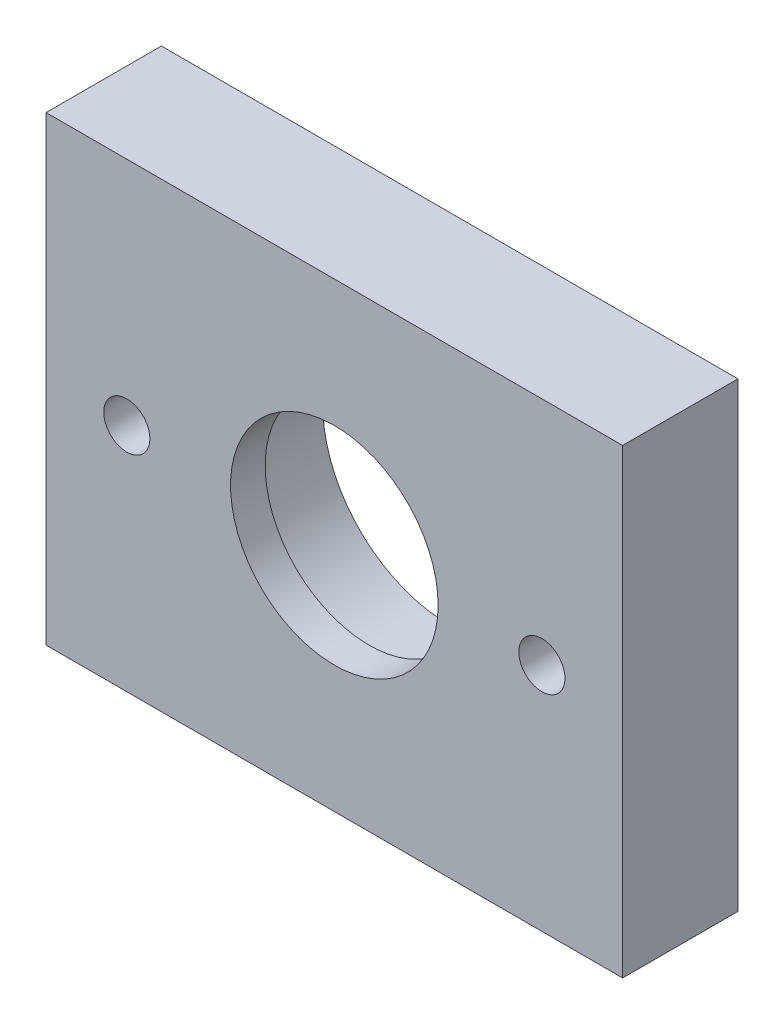
ISO-10303-21;
HEADER;
FILE_DESCRIPTION(('STEP AP214'),'2;1');
FILE_NAME('part.step','',(''),(''),'','','');
FILE_SCHEMA(('AUTOMOTIVE_DESIGN { 1 0 10303 214 1 1 1 1 }'));
ENDSEC;
DATA;
#1=APPLICATION_CONTEXT('core data for automotive mechanical design processes');
#2=APPLICATION_PROTOCOL_DEFINITION('international standard','automotive_design',2000,#1);
#3=PRODUCT_CONTEXT('',#1,'mechanical');
#4=PRODUCT('Part','Part','',(#3));
#5=PRODUCT_RELATED_PRODUCT_CATEGORY('part','',(#4));
#6=PRODUCT_DEFINITION_FORMATION('','',#4);
#7=PRODUCT_DEFINITION_CONTEXT('part definition',#1,'design');
#8=PRODUCT_DEFINITION('design','',#6,#7);
#9=PRODUCT_DEFINITION_SHAPE('','',#8);
#10=(LENGTH_UNIT() NAMED_UNIT(*) SI_UNIT(.MILLI.,.METRE.));
#11=(NAMED_UNIT(*) PLANE_ANGLE_UNIT() SI_UNIT($,.RADIAN.));
#12=(NAMED_UNIT(*) SI_UNIT($,.STERADIAN.) SOLID_ANGLE_UNIT());
#13=UNCERTAINTY_MEASURE_WITH_UNIT(LENGTH_MEASURE(1.E-05),#10,'distance_accuracy_value','');
#14=(GEOMETRIC_REPRESENTATION_CONTEXT(3) GLOBAL_UNCERTAINTY_ASSIGNED_CONTEXT((#13)) GLOBAL_UNIT_ASSIGNED_CONTEXT((#10,
#11,#12)) REPRESENTATION_CONTEXT('',''));
#15=CARTESIAN_POINT('',(0.,0.,0.));
#16=DIRECTION('',(0.,0.,1.));
#17=DIRECTION('',(1.,0.,0.));
#18=AXIS2_PLACEMENT_3D('',#15,#16,#17);
#19=CARTESIAN_POINT('',(0.,0.,10.));
#20=DIRECTION('',(0.,0.,-1.));
#21=DIRECTION('',(-1.,0.,0.));
#22=AXIS2_PLACEMENT_3D('',#19,#20,#21);
#23=CYLINDRICAL_SURFACE('',#22,11.);
#24=CARTESIAN_POINT('',(0.,0.,0.));
#25=DIRECTION('',(0.,0.,1.));
#26=DIRECTION('',(1.,0.,0.));
#27=AXIS2_PLACEMENT_3D('',#24,#25,#26);
#28=CIRCLE('',#27,11.);
#29=CARTESIAN_POINT('',(11.,0.,0.));
#30=VERTEX_POINT('',#29);
#31=EDGE_CURVE('E113',#30,#30,#28,.T.);
#32=ORIENTED_EDGE('',*,*,#31,.F.);
#33=EDGE_LOOP('',(#32));
#34=FACE_BOUND('',#33,.T.);
#35=CARTESIAN_POINT('',(0.,0.,7.));
#36=DIRECTION('',(0.,0.,1.));
#37=DIRECTION('',(1.,0.,0.));
#38=AXIS2_PLACEMENT_3D('',#35,#36,#37);
#39=CIRCLE('',#38,11.);
#40=CARTESIAN_POINT('',(11.,0.,7.));
#41=VERTEX_POINT('',#40);
#42=EDGE_CURVE('E147',#41,#41,#39,.T.);
#43=ORIENTED_EDGE('',*,*,#42,.T.);
#44=EDGE_LOOP('',(#43));
#45=FACE_BOUND('',#44,.T.);
#46=ADVANCED_FACE('F39',(#34,#45),#23,.F.);
#47=CARTESIAN_POINT('',(0.,0.,10.));
#48=DIRECTION('',(0.,0.,-1.));
#49=DIRECTION('',(-1.,0.,0.));
#50=AXIS2_PLACEMENT_3D('',#47,#48,#49);
#51=PLANE('',#50);
#52=DIRECTION('',(0.,1.,0.));
#53=VECTOR('',#52,1.);
#54=CARTESIAN_POINT('',(25.,-20.,10.));
#55=LINE('',#54,#53);
#56=CARTESIAN_POINT('',(25.,-20.,10.));
#57=VERTEX_POINT('',#56);
#58=CARTESIAN_POINT('',(25.,20.,10.));
#59=VERTEX_POINT('',#58);
#60=EDGE_CURVE('E93',#57,#59,#55,.T.);
#61=ORIENTED_EDGE('',*,*,#60,.T.);
#62=DIRECTION('',(-1.,0.,0.));
#63=VECTOR('',#62,1.);
#64=CARTESIAN_POINT('',(-25.,20.,10.));
#65=LINE('',#64,#63);
#66=CARTESIAN_POINT('',(-25.,20.,10.));
#67=VERTEX_POINT('',#66);
#68=EDGE_CURVE('E87',#59,#67,#65,.T.);
#69=ORIENTED_EDGE('',*,*,#68,.T.);
#70=DIRECTION('',(0.,-1.,0.));
#71=VECTOR('',#70,1.);
#72=CARTESIAN_POINT('',(-25.,-20.,10.));
#73=LINE('',#72,#71);
#74=CARTESIAN_POINT('',(-25.,-20.,10.));
#75=VERTEX_POINT('',#74);
#76=EDGE_CURVE('E91',#67,#75,#73,.T.);
#77=ORIENTED_EDGE('',*,*,#76,.T.);
#78=DIRECTION('',(1.,0.,0.));
#79=VECTOR('',#78,1.);
#80=CARTESIAN_POINT('',(-25.,-20.,10.));
#81=LINE('',#80,#79);
#82=EDGE_CURVE('E57',#75,#57,#81,.T.);
#83=ORIENTED_EDGE('',*,*,#82,.T.);
#84=EDGE_LOOP('',(#61,#69,#77,#83));
#85=FACE_BOUND('',#84,.T.);
#86=CARTESIAN_POINT('',(-18.,0.,10.));
#87=DIRECTION('',(0.,0.,1.));
#88=DIRECTION('',(1.,0.,0.));
#89=AXIS2_PLACEMENT_3D('',#86,#87,#88);
#90=CIRCLE('',#89,2.);
#91=CARTESIAN_POINT('',(-16.,0.,10.));
#92=VERTEX_POINT('',#91);
#93=EDGE_CURVE('E134',#92,#92,#90,.T.);
#94=ORIENTED_EDGE('',*,*,#93,.F.);
#95=EDGE_LOOP('',(#94));
#96=FACE_BOUND('',#95,.T.);
#97=CARTESIAN_POINT('',(18.,0.,10.));
#98=DIRECTION('',(0.,0.,1.));
#99=DIRECTION('',(-1.,0.,0.));
#100=AXIS2_PLACEMENT_3D('',#97,#98,#99);
#101=CIRCLE('',#100,2.);
#102=CARTESIAN_POINT('',(16.,0.,10.));
#103=VERTEX_POINT('',#102);
#104=EDGE_CURVE('E139',#103,#103,#101,.T.);
#105=ORIENTED_EDGE('',*,*,#104,.F.);
#106=EDGE_LOOP('',(#105));
#107=FACE_BOUND('',#106,.T.);
#108=CARTESIAN_POINT('',(0.,0.,10.));
#109=DIRECTION('',(0.,0.,1.));
#110=DIRECTION('',(1.,0.,0.));
#111=AXIS2_PLACEMENT_3D('',#108,#109,#110);
#112=CIRCLE('',#111,9.);
#113=CARTESIAN_POINT('',(9.,0.,10.));
#114=VERTEX_POINT('',#113);
#115=EDGE_CURVE('E155',#114,#114,#112,.T.);
#116=ORIENTED_EDGE('',*,*,#115,.F.);
#117=EDGE_LOOP('',(#116));
#118=FACE_BOUND('',#117,.T.);
#119=ADVANCED_FACE('F88',(#85,#96,#107,#118),#51,.F.);
#120=CARTESIAN_POINT('',(0.,0.,0.));
#121=DIRECTION('',(0.,0.,-1.));
#122=DIRECTION('',(-1.,0.,0.));
#123=AXIS2_PLACEMENT_3D('',#120,#121,#122);
#124=PLANE('',#123);
#125=CARTESIAN_POINT('',(-18.,0.,0.));
#126=DIRECTION('',(0.,0.,1.));
#127=DIRECTION('',(1.,0.,0.));
#128=AXIS2_PLACEMENT_3D('',#125,#126,#127);
#129=CIRCLE('',#128,2.);
#130=CARTESIAN_POINT('',(-16.,0.,0.));
#131=VERTEX_POINT('',#130);
#132=EDGE_CURVE('E135',#131,#131,#129,.T.);
#133=ORIENTED_EDGE('',*,*,#132,.T.);
#134=EDGE_LOOP('',(#133));
#135=FACE_BOUND('',#134,.T.);
#136=DIRECTION('',(0.,1.,0.));
#137=VECTOR('',#136,1.);
#138=CARTESIAN_POINT('',(25.,-20.,0.));
#139=LINE('',#138,#137);
#140=CARTESIAN_POINT('',(25.,-20.,0.));
#141=VERTEX_POINT('',#140);
#142=CARTESIAN_POINT('',(25.,20.,0.));
#143=VERTEX_POINT('',#142);
#144=EDGE_CURVE('E109',#141,#143,#139,.T.);
#145=ORIENTED_EDGE('',*,*,#144,.F.);
#146=DIRECTION('',(1.,0.,0.));
#147=VECTOR('',#146,1.);
#148=CARTESIAN_POINT('',(-25.,-20.,0.));
#149=LINE('',#148,#147);
#150=CARTESIAN_POINT('',(-25.,-20.,0.));
#151=VERTEX_POINT('',#150);
#152=EDGE_CURVE('E80',#151,#141,#149,.T.);
#153=ORIENTED_EDGE('',*,*,#152,.F.);
#154=DIRECTION('',(0.,-1.,0.));
#155=VECTOR('',#154,1.);
#156=CARTESIAN_POINT('',(-25.,-20.,0.));
#157=LINE('',#156,#155);
#158=CARTESIAN_POINT('',(-25.,20.,0.));
#159=VERTEX_POINT('',#158);
#160=EDGE_CURVE('E74',#159,#151,#157,.T.);
#161=ORIENTED_EDGE('',*,*,#160,.F.);
#162=DIRECTION('',(-1.,0.,0.));
#163=VECTOR('',#162,1.);
#164=CARTESIAN_POINT('',(-25.,20.,0.));
#165=LINE('',#164,#163);
#166=EDGE_CURVE('E98',#143,#159,#165,.T.);
#167=ORIENTED_EDGE('',*,*,#166,.F.);
#168=EDGE_LOOP('',(#145,#153,#161,#167));
#169=FACE_BOUND('',#168,.T.);
#170=ORIENTED_EDGE('',*,*,#31,.T.);
#171=EDGE_LOOP('',(#170));
#172=FACE_BOUND('',#171,.T.);
#173=CARTESIAN_POINT('',(18.,0.,0.));
#174=DIRECTION('',(0.,0.,1.));
#175=DIRECTION('',(-1.,0.,0.));
#176=AXIS2_PLACEMENT_3D('',#173,#174,#175);
#177=CIRCLE('',#176,2.);
#178=CARTESIAN_POINT('',(16.,0.,0.));
#179=VERTEX_POINT('',#178);
#180=EDGE_CURVE('E143',#179,#179,#177,.T.);
#181=ORIENTED_EDGE('',*,*,#180,.T.);
#182=EDGE_LOOP('',(#181));
#183=FACE_BOUND('',#182,.T.);
#184=ADVANCED_FACE('F126',(#135,#169,#172,#183),#124,.T.);
#185=CARTESIAN_POINT('',(25.,-20.,10.));
#186=DIRECTION('',(-1.,0.,0.));
#187=DIRECTION('',(0.,0.,1.));
#188=AXIS2_PLACEMENT_3D('',#185,#186,#187);
#189=PLANE('',#188);
#190=ORIENTED_EDGE('',*,*,#144,.T.);
#191=DIRECTION('',(0.,0.,-1.));
#192=VECTOR('',#191,1.);
#193=CARTESIAN_POINT('',(25.,20.,10.));
#194=LINE('',#193,#192);
#195=EDGE_CURVE('E11',#59,#143,#194,.T.);
#196=ORIENTED_EDGE('',*,*,#195,.F.);
#197=ORIENTED_EDGE('',*,*,#60,.F.);
#198=DIRECTION('',(0.,0.,-1.));
#199=VECTOR('',#198,1.);
#200=CARTESIAN_POINT('',(25.,-20.,10.));
#201=LINE('',#200,#199);
#202=EDGE_CURVE('E105',#57,#141,#201,.T.);
#203=ORIENTED_EDGE('',*,*,#202,.T.);
#204=EDGE_LOOP('',(#190,#196,#197,#203));
#205=FACE_BOUND('',#204,.T.);
#206=ADVANCED_FACE('F41',(#205),#189,.F.);
#207=CARTESIAN_POINT('',(-25.,20.,10.));
#208=DIRECTION('',(0.,-1.,0.));
#209=DIRECTION('',(0.,0.,-1.));
#210=AXIS2_PLACEMENT_3D('',#207,#208,#209);
#211=PLANE('',#210);
#212=ORIENTED_EDGE('',*,*,#166,.T.);
#213=DIRECTION('',(0.,0.,-1.));
#214=VECTOR('',#213,1.);
#215=CARTESIAN_POINT('',(-25.,20.,10.));
#216=LINE('',#215,#214);
#217=EDGE_CURVE('E49',#67,#159,#216,.T.);
#218=ORIENTED_EDGE('',*,*,#217,.F.);
#219=ORIENTED_EDGE('',*,*,#68,.F.);
#220=ORIENTED_EDGE('',*,*,#195,.T.);
#221=EDGE_LOOP('',(#212,#218,#219,#220));
#222=FACE_BOUND('',#221,.T.);
#223=ADVANCED_FACE('F97',(#222),#211,.F.);
#224=CARTESIAN_POINT('',(-25.,-20.,10.));
#225=DIRECTION('',(1.,0.,0.));
#226=DIRECTION('',(0.,0.,-1.));
#227=AXIS2_PLACEMENT_3D('',#224,#225,#226);
#228=PLANE('',#227);
#229=ORIENTED_EDGE('',*,*,#160,.T.);
#230=DIRECTION('',(0.,0.,-1.));
#231=VECTOR('',#230,1.);
#232=CARTESIAN_POINT('',(-25.,-20.,10.));
#233=LINE('',#232,#231);
#234=EDGE_CURVE('E100',#75,#151,#233,.T.);
#235=ORIENTED_EDGE('',*,*,#234,.F.);
#236=ORIENTED_EDGE('',*,*,#76,.F.);
#237=ORIENTED_EDGE('',*,*,#217,.T.);
#238=EDGE_LOOP('',(#229,#235,#236,#237));
#239=FACE_BOUND('',#238,.T.);
#240=ADVANCED_FACE('F101',(#239),#228,.F.);
#241=CARTESIAN_POINT('',(-25.,-20.,10.));
#242=DIRECTION('',(0.,1.,0.));
#243=DIRECTION('',(0.,0.,1.));
#244=AXIS2_PLACEMENT_3D('',#241,#242,#243);
#245=PLANE('',#244);
#246=ORIENTED_EDGE('',*,*,#152,.T.);
#247=ORIENTED_EDGE('',*,*,#202,.F.);
#248=ORIENTED_EDGE('',*,*,#82,.F.);
#249=ORIENTED_EDGE('',*,*,#234,.T.);
#250=EDGE_LOOP('',(#246,#247,#248,#249));
#251=FACE_BOUND('',#250,.T.);
#252=ADVANCED_FACE('F123',(#251),#245,.F.);
#253=CARTESIAN_POINT('',(-18.,0.,10.));
#254=DIRECTION('',(0.,0.,-1.));
#255=DIRECTION('',(-1.,0.,0.));
#256=AXIS2_PLACEMENT_3D('',#253,#254,#255);
#257=CYLINDRICAL_SURFACE('',#256,2.);
#258=ORIENTED_EDGE('',*,*,#93,.T.);
#259=EDGE_LOOP('',(#258));
#260=FACE_BOUND('',#259,.T.);
#261=ORIENTED_EDGE('',*,*,#132,.F.);
#262=EDGE_LOOP('',(#261));
#263=FACE_BOUND('',#262,.T.);
#264=ADVANCED_FACE('F186',(#260,#263),#257,.F.);
#265=CARTESIAN_POINT('',(18.,0.,10.));
#266=DIRECTION('',(0.,0.,-1.));
#267=DIRECTION('',(-1.,0.,0.));
#268=AXIS2_PLACEMENT_3D('',#265,#266,#267);
#269=CYLINDRICAL_SURFACE('',#268,2.);
#270=ORIENTED_EDGE('',*,*,#104,.T.);
#271=EDGE_LOOP('',(#270));
#272=FACE_BOUND('',#271,.T.);
#273=ORIENTED_EDGE('',*,*,#180,.F.);
#274=EDGE_LOOP('',(#273));
#275=FACE_BOUND('',#274,.T.);
#276=ADVANCED_FACE('F228',(#272,#275),#269,.F.);
#277=CARTESIAN_POINT('',(0.,0.,7.));
#278=DIRECTION('',(0.,0.,1.));
#279=DIRECTION('',(1.,0.,0.));
#280=AXIS2_PLACEMENT_3D('',#277,#278,#279);
#281=PLANE('',#280);
#282=CARTESIAN_POINT('',(0.,0.,7.));
#283=DIRECTION('',(0.,0.,1.));
#284=DIRECTION('',(1.,0.,0.));
#285=AXIS2_PLACEMENT_3D('',#282,#283,#284);
#286=CIRCLE('',#285,9.);
#287=CARTESIAN_POINT('',(9.,0.,7.));
#288=VERTEX_POINT('',#287);
#289=EDGE_CURVE('E154',#288,#288,#286,.T.);
#290=ORIENTED_EDGE('',*,*,#289,.T.);
#291=EDGE_LOOP('',(#290));
#292=FACE_BOUND('',#291,.T.);
#293=ORIENTED_EDGE('',*,*,#42,.F.);
#294=EDGE_LOOP('',(#293));
#295=FACE_BOUND('',#294,.T.);
#296=ADVANCED_FACE('F163',(#292,#295),#281,.F.);
#297=CARTESIAN_POINT('',(0.,0.,7.));
#298=DIRECTION('',(0.,0.,1.));
#299=DIRECTION('',(1.,0.,0.));
#300=AXIS2_PLACEMENT_3D('',#297,#298,#299);
#301=CYLINDRICAL_SURFACE('',#300,9.);
#302=ORIENTED_EDGE('',*,*,#289,.F.);
#303=EDGE_LOOP('',(#302));
#304=FACE_BOUND('',#303,.T.);
#305=ORIENTED_EDGE('',*,*,#115,.T.);
#306=EDGE_LOOP('',(#305));
#307=FACE_BOUND('',#306,.T.);
#308=ADVANCED_FACE('F166',(#304,#307),#301,.F.);
#309=CLOSED_SHELL('',(#46,#119,#184,#206,#223,#240,#252,#264,#276,#296,#308));
#310=MANIFOLD_SOLID_BREP('B2',#309);
#311=ADVANCED_BREP_SHAPE_REPRESENTATION('',(#18,#310),#14);
#312=SHAPE_DEFINITION_REPRESENTATION(#9,#311);
ENDSEC;
END-ISO-10303-21;
